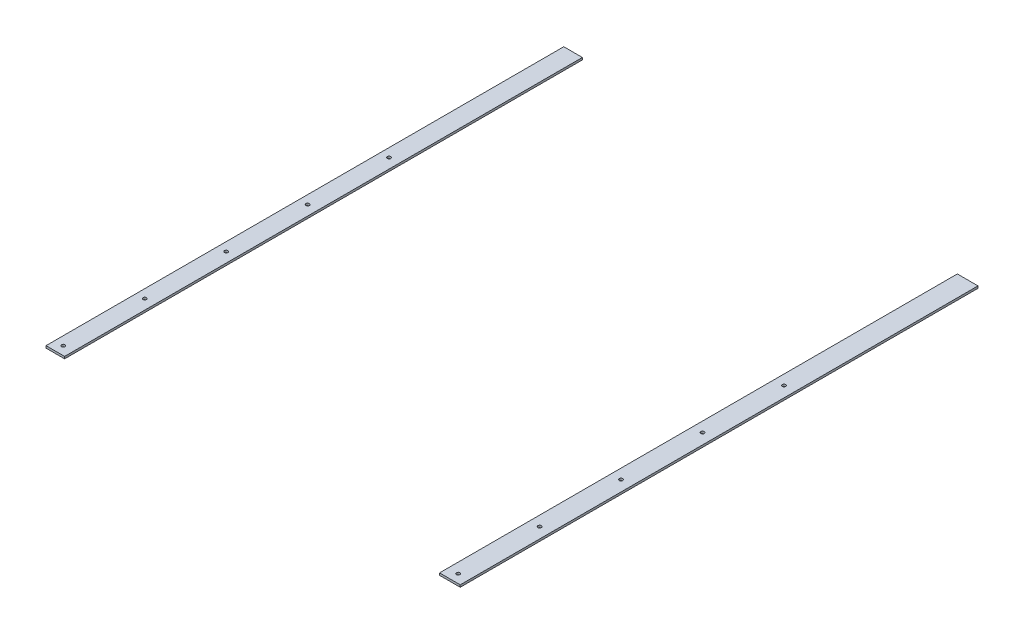
ISO-10303-21;
HEADER;
FILE_DESCRIPTION(('STEP AP214'),'2;1');
FILE_NAME('part.step','',(''),(''),'','','');
FILE_SCHEMA(('AUTOMOTIVE_DESIGN { 1 0 10303 214 1 1 1 1 }'));
ENDSEC;
DATA;
#1=APPLICATION_CONTEXT('core data for automotive mechanical design processes');
#2=APPLICATION_PROTOCOL_DEFINITION('international standard','automotive_design',2000,#1);
#3=PRODUCT_CONTEXT('',#1,'mechanical');
#4=PRODUCT('Part','Part','',(#3));
#5=PRODUCT_RELATED_PRODUCT_CATEGORY('part','',(#4));
#6=PRODUCT_DEFINITION_FORMATION('','',#4);
#7=PRODUCT_DEFINITION_CONTEXT('part definition',#1,'design');
#8=PRODUCT_DEFINITION('design','',#6,#7);
#9=PRODUCT_DEFINITION_SHAPE('','',#8);
#10=(LENGTH_UNIT() NAMED_UNIT(*) SI_UNIT(.MILLI.,.METRE.));
#11=(NAMED_UNIT(*) PLANE_ANGLE_UNIT() SI_UNIT($,.RADIAN.));
#12=(NAMED_UNIT(*) SI_UNIT($,.STERADIAN.) SOLID_ANGLE_UNIT());
#13=UNCERTAINTY_MEASURE_WITH_UNIT(LENGTH_MEASURE(1.E-05),#10,'distance_accuracy_value','');
#14=(GEOMETRIC_REPRESENTATION_CONTEXT(3) GLOBAL_UNCERTAINTY_ASSIGNED_CONTEXT((#13)) GLOBAL_UNIT_ASSIGNED_CONTEXT((#10,
#11,#12)) REPRESENTATION_CONTEXT('',''));
#15=CARTESIAN_POINT('',(0.,0.,0.));
#16=DIRECTION('',(0.,0.,1.));
#17=DIRECTION('',(1.,0.,0.));
#18=AXIS2_PLACEMENT_3D('',#15,#16,#17);
#19=CARTESIAN_POINT('',(0.,3.175,0.));
#20=DIRECTION('',(0.,-1.,0.));
#21=DIRECTION('',(0.,0.,-1.));
#22=AXIS2_PLACEMENT_3D('',#19,#20,#21);
#23=PLANE('',#22);
#24=CARTESIAN_POINT('',(12.6999999999983,3.175,-492.252));
#25=DIRECTION('',(0.,1.,0.));
#26=DIRECTION('',(0.,0.,1.));
#27=AXIS2_PLACEMENT_3D('',#24,#25,#26);
#28=CIRCLE('',#27,2.54);
#29=CARTESIAN_POINT('',(12.6999999999983,3.175,-489.712));
#30=VERTEX_POINT('',#29);
#31=EDGE_CURVE('E151',#30,#30,#28,.T.);
#32=ORIENTED_EDGE('',*,*,#31,.F.);
#33=EDGE_LOOP('',(#32));
#34=FACE_BOUND('',#33,.T.);
#35=CARTESIAN_POINT('',(12.6999999999987,3.175,-372.364));
#36=DIRECTION('',(0.,1.,0.));
#37=DIRECTION('',(0.,0.,1.));
#38=AXIS2_PLACEMENT_3D('',#35,#36,#37);
#39=CIRCLE('',#38,2.54);
#40=CARTESIAN_POINT('',(12.6999999999987,3.175,-369.824));
#41=VERTEX_POINT('',#40);
#42=EDGE_CURVE('E144',#41,#41,#39,.T.);
#43=ORIENTED_EDGE('',*,*,#42,.F.);
#44=EDGE_LOOP('',(#43));
#45=FACE_BOUND('',#44,.T.);
#46=CARTESIAN_POINT('',(12.6999999999992,3.175,-252.476));
#47=DIRECTION('',(0.,1.,0.));
#48=DIRECTION('',(0.,0.,1.));
#49=AXIS2_PLACEMENT_3D('',#46,#47,#48);
#50=CIRCLE('',#49,2.54);
#51=CARTESIAN_POINT('',(12.6999999999992,3.175,-249.936));
#52=VERTEX_POINT('',#51);
#53=EDGE_CURVE('E136',#52,#52,#50,.T.);
#54=ORIENTED_EDGE('',*,*,#53,.F.);
#55=EDGE_LOOP('',(#54));
#56=FACE_BOUND('',#55,.T.);
#57=CARTESIAN_POINT('',(12.6999999999996,3.175,-132.588));
#58=DIRECTION('',(0.,1.,0.));
#59=DIRECTION('',(0.,0.,1.));
#60=AXIS2_PLACEMENT_3D('',#57,#58,#59);
#61=CIRCLE('',#60,2.54);
#62=CARTESIAN_POINT('',(12.6999999999996,3.175,-130.048));
#63=VERTEX_POINT('',#62);
#64=EDGE_CURVE('E128',#63,#63,#61,.T.);
#65=ORIENTED_EDGE('',*,*,#64,.F.);
#66=EDGE_LOOP('',(#65));
#67=FACE_BOUND('',#66,.T.);
#68=CARTESIAN_POINT('',(12.7,3.175,-12.7));
#69=DIRECTION('',(0.,1.,0.));
#70=DIRECTION('',(0.,0.,1.));
#71=AXIS2_PLACEMENT_3D('',#68,#69,#70);
#72=CIRCLE('',#71,2.54);
#73=CARTESIAN_POINT('',(12.7,3.175,-10.16));
#74=VERTEX_POINT('',#73);
#75=EDGE_CURVE('E117',#74,#74,#72,.T.);
#76=ORIENTED_EDGE('',*,*,#75,.F.);
#77=EDGE_LOOP('',(#76));
#78=FACE_BOUND('',#77,.T.);
#79=DIRECTION('',(1.,0.,0.));
#80=VECTOR('',#79,1.);
#81=CARTESIAN_POINT('',(0.,3.175,0.));
#82=LINE('',#81,#80);
#83=CARTESIAN_POINT('',(0.,3.175,0.));
#84=VERTEX_POINT('',#83);
#85=CARTESIAN_POINT('',(27.3685809402195,3.175,0.));
#86=VERTEX_POINT('',#85);
#87=EDGE_CURVE('E94',#84,#86,#82,.T.);
#88=ORIENTED_EDGE('',*,*,#87,.T.);
#89=DIRECTION('',(0.,0.,1.));
#90=VECTOR('',#89,1.);
#91=CARTESIAN_POINT('',(27.3685809402195,3.175,0.));
#92=LINE('',#91,#90);
#93=CARTESIAN_POINT('',(27.3685809402195,3.175,-762.));
#94=VERTEX_POINT('',#93);
#95=EDGE_CURVE('E12',#94,#86,#92,.T.);
#96=ORIENTED_EDGE('',*,*,#95,.F.);
#97=DIRECTION('',(-1.,0.,0.));
#98=VECTOR('',#97,1.);
#99=CARTESIAN_POINT('',(0.,3.175,-762.));
#100=LINE('',#99,#98);
#101=CARTESIAN_POINT('',(0.,3.175,-762.));
#102=VERTEX_POINT('',#101);
#103=EDGE_CURVE('E101',#94,#102,#100,.T.);
#104=ORIENTED_EDGE('',*,*,#103,.T.);
#105=DIRECTION('',(0.,0.,1.));
#106=VECTOR('',#105,1.);
#107=CARTESIAN_POINT('',(0.,3.175,0.));
#108=LINE('',#107,#106);
#109=EDGE_CURVE('E99',#102,#84,#108,.T.);
#110=ORIENTED_EDGE('',*,*,#109,.T.);
#111=EDGE_LOOP('',(#88,#96,#104,#110));
#112=FACE_BOUND('',#111,.T.);
#113=ADVANCED_FACE('F48',(#34,#45,#56,#67,#78,#112),#23,.F.);
#114=CARTESIAN_POINT('',(0.,0.,0.));
#115=DIRECTION('',(0.,-1.,0.));
#116=DIRECTION('',(0.,0.,-1.));
#117=AXIS2_PLACEMENT_3D('',#114,#115,#116);
#118=PLANE('',#117);
#119=DIRECTION('',(0.,0.,1.));
#120=VECTOR('',#119,1.);
#121=CARTESIAN_POINT('',(27.3685809402195,0.,0.));
#122=LINE('',#121,#120);
#123=CARTESIAN_POINT('',(27.3685809402195,0.,-762.));
#124=VERTEX_POINT('',#123);
#125=CARTESIAN_POINT('',(27.3685809402195,0.,0.));
#126=VERTEX_POINT('',#125);
#127=EDGE_CURVE('E66',#124,#126,#122,.T.);
#128=ORIENTED_EDGE('',*,*,#127,.T.);
#129=DIRECTION('',(1.,0.,0.));
#130=VECTOR('',#129,1.);
#131=CARTESIAN_POINT('',(0.,0.,0.));
#132=LINE('',#131,#130);
#133=CARTESIAN_POINT('',(0.,0.,0.));
#134=VERTEX_POINT('',#133);
#135=EDGE_CURVE('E51',#134,#126,#132,.T.);
#136=ORIENTED_EDGE('',*,*,#135,.F.);
#137=DIRECTION('',(0.,0.,1.));
#138=VECTOR('',#137,1.);
#139=CARTESIAN_POINT('',(0.,0.,0.));
#140=LINE('',#139,#138);
#141=CARTESIAN_POINT('',(0.,0.,-762.));
#142=VERTEX_POINT('',#141);
#143=EDGE_CURVE('E106',#142,#134,#140,.T.);
#144=ORIENTED_EDGE('',*,*,#143,.F.);
#145=DIRECTION('',(-1.,0.,0.));
#146=VECTOR('',#145,1.);
#147=CARTESIAN_POINT('',(0.,0.,-762.));
#148=LINE('',#147,#146);
#149=EDGE_CURVE('E105',#124,#142,#148,.T.);
#150=ORIENTED_EDGE('',*,*,#149,.F.);
#151=EDGE_LOOP('',(#128,#136,#144,#150));
#152=FACE_BOUND('',#151,.T.);
#153=CARTESIAN_POINT('',(12.6999999999983,0.,-492.252));
#154=DIRECTION('',(0.,1.,0.));
#155=DIRECTION('',(0.,0.,1.));
#156=AXIS2_PLACEMENT_3D('',#153,#154,#155);
#157=CIRCLE('',#156,2.54);
#158=CARTESIAN_POINT('',(12.6999999999983,0.,-489.712));
#159=VERTEX_POINT('',#158);
#160=EDGE_CURVE('E140',#159,#159,#157,.T.);
#161=ORIENTED_EDGE('',*,*,#160,.T.);
#162=EDGE_LOOP('',(#161));
#163=FACE_BOUND('',#162,.T.);
#164=CARTESIAN_POINT('',(12.6999999999992,0.,-252.476));
#165=DIRECTION('',(0.,1.,0.));
#166=DIRECTION('',(0.,0.,1.));
#167=AXIS2_PLACEMENT_3D('',#164,#165,#166);
#168=CIRCLE('',#167,2.54);
#169=CARTESIAN_POINT('',(12.6999999999992,0.,-249.936));
#170=VERTEX_POINT('',#169);
#171=EDGE_CURVE('E125',#170,#170,#168,.T.);
#172=ORIENTED_EDGE('',*,*,#171,.T.);
#173=EDGE_LOOP('',(#172));
#174=FACE_BOUND('',#173,.T.);
#175=CARTESIAN_POINT('',(12.7,0.,-12.7));
#176=DIRECTION('',(0.,1.,0.));
#177=DIRECTION('',(0.,0.,1.));
#178=AXIS2_PLACEMENT_3D('',#175,#176,#177);
#179=CIRCLE('',#178,2.54);
#180=CARTESIAN_POINT('',(12.7,0.,-10.16));
#181=VERTEX_POINT('',#180);
#182=EDGE_CURVE('E121',#181,#181,#179,.T.);
#183=ORIENTED_EDGE('',*,*,#182,.T.);
#184=EDGE_LOOP('',(#183));
#185=FACE_BOUND('',#184,.T.);
#186=CARTESIAN_POINT('',(12.6999999999996,0.,-132.588));
#187=DIRECTION('',(0.,1.,0.));
#188=DIRECTION('',(0.,0.,1.));
#189=AXIS2_PLACEMENT_3D('',#186,#187,#188);
#190=CIRCLE('',#189,2.54);
#191=CARTESIAN_POINT('',(12.6999999999996,0.,-130.048));
#192=VERTEX_POINT('',#191);
#193=EDGE_CURVE('E124',#192,#192,#190,.T.);
#194=ORIENTED_EDGE('',*,*,#193,.T.);
#195=EDGE_LOOP('',(#194));
#196=FACE_BOUND('',#195,.T.);
#197=CARTESIAN_POINT('',(12.6999999999987,0.,-372.364));
#198=DIRECTION('',(0.,1.,0.));
#199=DIRECTION('',(0.,0.,1.));
#200=AXIS2_PLACEMENT_3D('',#197,#198,#199);
#201=CIRCLE('',#200,2.54);
#202=CARTESIAN_POINT('',(12.6999999999987,0.,-369.824));
#203=VERTEX_POINT('',#202);
#204=EDGE_CURVE('E132',#203,#203,#201,.T.);
#205=ORIENTED_EDGE('',*,*,#204,.T.);
#206=EDGE_LOOP('',(#205));
#207=FACE_BOUND('',#206,.T.);
#208=ADVANCED_FACE('F160',(#152,#163,#174,#185,#196,#207),#118,.T.);
#209=CARTESIAN_POINT('',(0.,3.175,0.));
#210=DIRECTION('',(0.,0.,-1.));
#211=DIRECTION('',(-1.,0.,0.));
#212=AXIS2_PLACEMENT_3D('',#209,#210,#211);
#213=PLANE('',#212);
#214=ORIENTED_EDGE('',*,*,#135,.T.);
#215=DIRECTION('',(0.,1.,0.));
#216=VECTOR('',#215,1.);
#217=CARTESIAN_POINT('',(27.3685809402195,-0.00100000000000013,0.));
#218=LINE('',#217,#216);
#219=EDGE_CURVE('E86',#126,#86,#218,.T.);
#220=ORIENTED_EDGE('',*,*,#219,.T.);
#221=ORIENTED_EDGE('',*,*,#87,.F.);
#222=DIRECTION('',(0.,-1.,0.));
#223=VECTOR('',#222,1.);
#224=CARTESIAN_POINT('',(0.,3.175,0.));
#225=LINE('',#224,#223);
#226=EDGE_CURVE('E96',#84,#134,#225,.T.);
#227=ORIENTED_EDGE('',*,*,#226,.T.);
#228=EDGE_LOOP('',(#214,#220,#221,#227));
#229=FACE_BOUND('',#228,.T.);
#230=ADVANCED_FACE('F92',(#229),#213,.F.);
#231=CARTESIAN_POINT('',(0.,3.175,-762.));
#232=DIRECTION('',(0.,0.,1.));
#233=DIRECTION('',(1.,0.,0.));
#234=AXIS2_PLACEMENT_3D('',#231,#232,#233);
#235=PLANE('',#234);
#236=ORIENTED_EDGE('',*,*,#103,.F.);
#237=DIRECTION('',(0.,1.,0.));
#238=VECTOR('',#237,1.);
#239=CARTESIAN_POINT('',(27.3685809402195,-0.00100000000000013,-762.));
#240=LINE('',#239,#238);
#241=EDGE_CURVE('E58',#124,#94,#240,.T.);
#242=ORIENTED_EDGE('',*,*,#241,.F.);
#243=ORIENTED_EDGE('',*,*,#149,.T.);
#244=DIRECTION('',(0.,-1.,0.));
#245=VECTOR('',#244,1.);
#246=CARTESIAN_POINT('',(0.,3.175,-762.));
#247=LINE('',#246,#245);
#248=EDGE_CURVE('E113',#102,#142,#247,.T.);
#249=ORIENTED_EDGE('',*,*,#248,.F.);
#250=EDGE_LOOP('',(#236,#242,#243,#249));
#251=FACE_BOUND('',#250,.T.);
#252=ADVANCED_FACE('F165',(#251),#235,.F.);
#253=CARTESIAN_POINT('',(0.,3.175,0.));
#254=DIRECTION('',(1.,0.,0.));
#255=DIRECTION('',(0.,0.,-1.));
#256=AXIS2_PLACEMENT_3D('',#253,#254,#255);
#257=PLANE('',#256);
#258=ORIENTED_EDGE('',*,*,#143,.T.);
#259=ORIENTED_EDGE('',*,*,#226,.F.);
#260=ORIENTED_EDGE('',*,*,#109,.F.);
#261=ORIENTED_EDGE('',*,*,#248,.T.);
#262=EDGE_LOOP('',(#258,#259,#260,#261));
#263=FACE_BOUND('',#262,.T.);
#264=ADVANCED_FACE('F164',(#263),#257,.F.);
#265=CARTESIAN_POINT('',(12.7,3.175,-12.7));
#266=DIRECTION('',(0.,-1.,0.));
#267=DIRECTION('',(0.,0.,-1.));
#268=AXIS2_PLACEMENT_3D('',#265,#266,#267);
#269=CYLINDRICAL_SURFACE('',#268,2.54);
#270=ORIENTED_EDGE('',*,*,#75,.T.);
#271=EDGE_LOOP('',(#270));
#272=FACE_BOUND('',#271,.T.);
#273=ORIENTED_EDGE('',*,*,#182,.F.);
#274=EDGE_LOOP('',(#273));
#275=FACE_BOUND('',#274,.T.);
#276=ADVANCED_FACE('F172',(#272,#275),#269,.F.);
#277=CARTESIAN_POINT('',(12.6999999999996,3.175,-132.588));
#278=DIRECTION('',(0.,-1.,0.));
#279=DIRECTION('',(0.,0.,-1.));
#280=AXIS2_PLACEMENT_3D('',#277,#278,#279);
#281=CYLINDRICAL_SURFACE('',#280,2.54);
#282=ORIENTED_EDGE('',*,*,#64,.T.);
#283=EDGE_LOOP('',(#282));
#284=FACE_BOUND('',#283,.T.);
#285=ORIENTED_EDGE('',*,*,#193,.F.);
#286=EDGE_LOOP('',(#285));
#287=FACE_BOUND('',#286,.T.);
#288=ADVANCED_FACE('F192',(#284,#287),#281,.F.);
#289=CARTESIAN_POINT('',(12.6999999999992,3.175,-252.476));
#290=DIRECTION('',(0.,-1.,0.));
#291=DIRECTION('',(0.,0.,-1.));
#292=AXIS2_PLACEMENT_3D('',#289,#290,#291);
#293=CYLINDRICAL_SURFACE('',#292,2.54);
#294=ORIENTED_EDGE('',*,*,#53,.T.);
#295=EDGE_LOOP('',(#294));
#296=FACE_BOUND('',#295,.T.);
#297=ORIENTED_EDGE('',*,*,#171,.F.);
#298=EDGE_LOOP('',(#297));
#299=FACE_BOUND('',#298,.T.);
#300=ADVANCED_FACE('F204',(#296,#299),#293,.F.);
#301=CARTESIAN_POINT('',(12.6999999999987,3.175,-372.364));
#302=DIRECTION('',(0.,-1.,0.));
#303=DIRECTION('',(0.,0.,-1.));
#304=AXIS2_PLACEMENT_3D('',#301,#302,#303);
#305=CYLINDRICAL_SURFACE('',#304,2.54);
#306=ORIENTED_EDGE('',*,*,#42,.T.);
#307=EDGE_LOOP('',(#306));
#308=FACE_BOUND('',#307,.T.);
#309=ORIENTED_EDGE('',*,*,#204,.F.);
#310=EDGE_LOOP('',(#309));
#311=FACE_BOUND('',#310,.T.);
#312=ADVANCED_FACE('F201',(#308,#311),#305,.F.);
#313=CARTESIAN_POINT('',(12.6999999999983,3.175,-492.252));
#314=DIRECTION('',(0.,-1.,0.));
#315=DIRECTION('',(0.,0.,-1.));
#316=AXIS2_PLACEMENT_3D('',#313,#314,#315);
#317=CYLINDRICAL_SURFACE('',#316,2.54);
#318=ORIENTED_EDGE('',*,*,#31,.T.);
#319=EDGE_LOOP('',(#318));
#320=FACE_BOUND('',#319,.T.);
#321=ORIENTED_EDGE('',*,*,#160,.F.);
#322=EDGE_LOOP('',(#321));
#323=FACE_BOUND('',#322,.T.);
#324=ADVANCED_FACE('F203',(#320,#323),#317,.F.);
#325=CARTESIAN_POINT('',(27.3685809402195,-0.00100000000000013,0.));
#326=DIRECTION('',(-1.,0.,0.));
#327=DIRECTION('',(0.,0.,1.));
#328=AXIS2_PLACEMENT_3D('',#325,#326,#327);
#329=PLANE('',#328);
#330=ORIENTED_EDGE('',*,*,#241,.T.);
#331=ORIENTED_EDGE('',*,*,#95,.T.);
#332=ORIENTED_EDGE('',*,*,#219,.F.);
#333=ORIENTED_EDGE('',*,*,#127,.F.);
#334=EDGE_LOOP('',(#330,#331,#332,#333));
#335=FACE_BOUND('',#334,.T.);
#336=ADVANCED_FACE('F85',(#335),#329,.F.);
#337=CLOSED_SHELL('',(#113,#208,#230,#252,#264,#276,#288,#300,#312,#324,#336));
#338=MANIFOLD_SOLID_BREP('B2',#337);
#339=CARTESIAN_POINT('',(593.851999999998,3.175,-492.252));
#340=DIRECTION('',(0.,-1.,0.));
#341=DIRECTION('',(0.,0.,-1.));
#342=AXIS2_PLACEMENT_3D('',#339,#340,#341);
#343=CYLINDRICAL_SURFACE('',#342,2.53999999999996);
#344=CARTESIAN_POINT('',(593.851999999998,3.175,-492.252));
#345=DIRECTION('',(0.,1.,0.));
#346=DIRECTION('',(0.,0.,1.));
#347=AXIS2_PLACEMENT_3D('',#344,#345,#346);
#348=CIRCLE('',#347,2.53999999999996);
#349=CARTESIAN_POINT('',(593.851999999998,3.175,-489.712));
#350=VERTEX_POINT('',#349);
#351=EDGE_CURVE('E395',#350,#350,#348,.T.);
#352=ORIENTED_EDGE('',*,*,#351,.T.);
#353=EDGE_LOOP('',(#352));
#354=FACE_BOUND('',#353,.T.);
#355=CARTESIAN_POINT('',(593.851999999998,0.,-492.252));
#356=DIRECTION('',(0.,1.,0.));
#357=DIRECTION('',(0.,0.,1.));
#358=AXIS2_PLACEMENT_3D('',#355,#356,#357);
#359=CIRCLE('',#358,2.53999999999996);
#360=CARTESIAN_POINT('',(593.851999999998,0.,-489.712));
#361=VERTEX_POINT('',#360);
#362=EDGE_CURVE('E399',#361,#361,#359,.T.);
#363=ORIENTED_EDGE('',*,*,#362,.F.);
#364=EDGE_LOOP('',(#363));
#365=FACE_BOUND('',#364,.T.);
#366=ADVANCED_FACE('F295',(#354,#365),#343,.F.);
#367=CARTESIAN_POINT('',(593.851999999999,3.175,-252.476));
#368=DIRECTION('',(0.,-1.,0.));
#369=DIRECTION('',(0.,0.,-1.));
#370=AXIS2_PLACEMENT_3D('',#367,#368,#369);
#371=CYLINDRICAL_SURFACE('',#370,2.53999999999996);
#372=CARTESIAN_POINT('',(593.851999999999,3.175,-252.476));
#373=DIRECTION('',(0.,1.,0.));
#374=DIRECTION('',(0.,0.,1.));
#375=AXIS2_PLACEMENT_3D('',#372,#373,#374);
#376=CIRCLE('',#375,2.53999999999996);
#377=CARTESIAN_POINT('',(593.851999999999,3.175,-249.936));
#378=VERTEX_POINT('',#377);
#379=EDGE_CURVE('E379',#378,#378,#376,.T.);
#380=ORIENTED_EDGE('',*,*,#379,.T.);
#381=EDGE_LOOP('',(#380));
#382=FACE_BOUND('',#381,.T.);
#383=CARTESIAN_POINT('',(593.851999999999,0.,-252.476));
#384=DIRECTION('',(0.,1.,0.));
#385=DIRECTION('',(0.,0.,1.));
#386=AXIS2_PLACEMENT_3D('',#383,#384,#385);
#387=CIRCLE('',#386,2.53999999999996);
#388=CARTESIAN_POINT('',(593.851999999999,0.,-249.936));
#389=VERTEX_POINT('',#388);
#390=EDGE_CURVE('E383',#389,#389,#387,.T.);
#391=ORIENTED_EDGE('',*,*,#390,.F.);
#392=EDGE_LOOP('',(#391));
#393=FACE_BOUND('',#392,.T.);
#394=ADVANCED_FACE('F433',(#382,#393),#371,.F.);
#395=CARTESIAN_POINT('',(593.852,3.175,-12.7));
#396=DIRECTION('',(0.,-1.,0.));
#397=DIRECTION('',(0.,0.,-1.));
#398=AXIS2_PLACEMENT_3D('',#395,#396,#397);
#399=CYLINDRICAL_SURFACE('',#398,2.53999999999996);
#400=CARTESIAN_POINT('',(593.852,3.175,-12.7));
#401=DIRECTION('',(0.,1.,0.));
#402=DIRECTION('',(0.,0.,1.));
#403=AXIS2_PLACEMENT_3D('',#400,#401,#402);
#404=CIRCLE('',#403,2.53999999999996);
#405=CARTESIAN_POINT('',(593.852,3.175,-10.16));
#406=VERTEX_POINT('',#405);
#407=EDGE_CURVE('E363',#406,#406,#404,.T.);
#408=ORIENTED_EDGE('',*,*,#407,.T.);
#409=EDGE_LOOP('',(#408));
#410=FACE_BOUND('',#409,.T.);
#411=CARTESIAN_POINT('',(593.852,0.,-12.7));
#412=DIRECTION('',(0.,1.,0.));
#413=DIRECTION('',(0.,0.,1.));
#414=AXIS2_PLACEMENT_3D('',#411,#412,#413);
#415=CIRCLE('',#414,2.53999999999996);
#416=CARTESIAN_POINT('',(593.852,0.,-10.16));
#417=VERTEX_POINT('',#416);
#418=EDGE_CURVE('E367',#417,#417,#415,.T.);
#419=ORIENTED_EDGE('',*,*,#418,.F.);
#420=EDGE_LOOP('',(#419));
#421=FACE_BOUND('',#420,.T.);
#422=ADVANCED_FACE('F438',(#410,#421),#399,.F.);
#423=CARTESIAN_POINT('',(593.852,3.175,-132.588));
#424=DIRECTION('',(0.,-1.,0.));
#425=DIRECTION('',(0.,0.,-1.));
#426=AXIS2_PLACEMENT_3D('',#423,#424,#425);
#427=CYLINDRICAL_SURFACE('',#426,2.53999999999996);
#428=CARTESIAN_POINT('',(593.852,3.175,-132.588));
#429=DIRECTION('',(0.,1.,0.));
#430=DIRECTION('',(0.,0.,1.));
#431=AXIS2_PLACEMENT_3D('',#428,#429,#430);
#432=CIRCLE('',#431,2.53999999999996);
#433=CARTESIAN_POINT('',(593.852,3.175,-130.048));
#434=VERTEX_POINT('',#433);
#435=EDGE_CURVE('E371',#434,#434,#432,.T.);
#436=ORIENTED_EDGE('',*,*,#435,.T.);
#437=EDGE_LOOP('',(#436));
#438=FACE_BOUND('',#437,.T.);
#439=CARTESIAN_POINT('',(593.852,0.,-132.588));
#440=DIRECTION('',(0.,1.,0.));
#441=DIRECTION('',(0.,0.,1.));
#442=AXIS2_PLACEMENT_3D('',#439,#440,#441);
#443=CIRCLE('',#442,2.53999999999996);
#444=CARTESIAN_POINT('',(593.852,0.,-130.048));
#445=VERTEX_POINT('',#444);
#446=EDGE_CURVE('E375',#445,#445,#443,.T.);
#447=ORIENTED_EDGE('',*,*,#446,.F.);
#448=EDGE_LOOP('',(#447));
#449=FACE_BOUND('',#448,.T.);
#450=ADVANCED_FACE('F445',(#438,#449),#427,.F.);
#451=CARTESIAN_POINT('',(593.851999999999,3.175,-372.364));
#452=DIRECTION('',(0.,-1.,0.));
#453=DIRECTION('',(0.,0.,-1.));
#454=AXIS2_PLACEMENT_3D('',#451,#452,#453);
#455=CYLINDRICAL_SURFACE('',#454,2.53999999999996);
#456=CARTESIAN_POINT('',(593.851999999999,3.175,-372.364));
#457=DIRECTION('',(0.,1.,0.));
#458=DIRECTION('',(0.,0.,1.));
#459=AXIS2_PLACEMENT_3D('',#456,#457,#458);
#460=CIRCLE('',#459,2.53999999999996);
#461=CARTESIAN_POINT('',(593.851999999999,3.175,-369.824));
#462=VERTEX_POINT('',#461);
#463=EDGE_CURVE('E387',#462,#462,#460,.T.);
#464=ORIENTED_EDGE('',*,*,#463,.T.);
#465=EDGE_LOOP('',(#464));
#466=FACE_BOUND('',#465,.T.);
#467=CARTESIAN_POINT('',(593.851999999999,0.,-372.364));
#468=DIRECTION('',(0.,1.,0.));
#469=DIRECTION('',(0.,0.,1.));
#470=AXIS2_PLACEMENT_3D('',#467,#468,#469);
#471=CIRCLE('',#470,2.53999999999996);
#472=CARTESIAN_POINT('',(593.851999999999,0.,-369.824));
#473=VERTEX_POINT('',#472);
#474=EDGE_CURVE('E391',#473,#473,#471,.T.);
#475=ORIENTED_EDGE('',*,*,#474,.F.);
#476=EDGE_LOOP('',(#475));
#477=FACE_BOUND('',#476,.T.);
#478=ADVANCED_FACE('F443',(#466,#477),#455,.F.);
#479=CARTESIAN_POINT('',(609.6,3.175,0.));
#480=DIRECTION('',(-1.,0.,0.));
#481=DIRECTION('',(0.,0.,1.));
#482=AXIS2_PLACEMENT_3D('',#479,#480,#481);
#483=PLANE('',#482);
#484=DIRECTION('',(0.,0.,-1.));
#485=VECTOR('',#484,1.);
#486=CARTESIAN_POINT('',(609.6,0.,0.));
#487=LINE('',#486,#485);
#488=CARTESIAN_POINT('',(609.6,0.,0.));
#489=VERTEX_POINT('',#488);
#490=CARTESIAN_POINT('',(609.6,0.,-762.));
#491=VERTEX_POINT('',#490);
#492=EDGE_CURVE('E334',#489,#491,#487,.T.);
#493=ORIENTED_EDGE('',*,*,#492,.T.);
#494=DIRECTION('',(0.,-1.,0.));
#495=VECTOR('',#494,1.);
#496=CARTESIAN_POINT('',(609.6,3.175,-762.));
#497=LINE('',#496,#495);
#498=CARTESIAN_POINT('',(609.6,3.175,-762.));
#499=VERTEX_POINT('',#498);
#500=EDGE_CURVE('E304',#499,#491,#497,.T.);
#501=ORIENTED_EDGE('',*,*,#500,.F.);
#502=DIRECTION('',(0.,0.,-1.));
#503=VECTOR('',#502,1.);
#504=CARTESIAN_POINT('',(609.6,3.175,0.));
#505=LINE('',#504,#503);
#506=CARTESIAN_POINT('',(609.6,3.175,0.));
#507=VERTEX_POINT('',#506);
#508=EDGE_CURVE('E320',#507,#499,#505,.T.);
#509=ORIENTED_EDGE('',*,*,#508,.F.);
#510=DIRECTION('',(0.,-1.,0.));
#511=VECTOR('',#510,1.);
#512=CARTESIAN_POINT('',(609.6,3.175,0.));
#513=LINE('',#512,#511);
#514=EDGE_CURVE('E46',#507,#489,#513,.T.);
#515=ORIENTED_EDGE('',*,*,#514,.T.);
#516=EDGE_LOOP('',(#493,#501,#509,#515));
#517=FACE_BOUND('',#516,.T.);
#518=ADVANCED_FACE('F336',(#517),#483,.F.);
#519=CARTESIAN_POINT('',(0.,3.175,0.));
#520=DIRECTION('',(0.,0.,-1.));
#521=DIRECTION('',(-1.,0.,0.));
#522=AXIS2_PLACEMENT_3D('',#519,#520,#521);
#523=PLANE('',#522);
#524=DIRECTION('',(1.,0.,0.));
#525=VECTOR('',#524,1.);
#526=CARTESIAN_POINT('',(0.,3.175,0.));
#527=LINE('',#526,#525);
#528=CARTESIAN_POINT('',(579.183419059781,3.175,0.));
#529=VERTEX_POINT('',#528);
#530=EDGE_CURVE('E356',#529,#507,#527,.T.);
#531=ORIENTED_EDGE('',*,*,#530,.F.);
#532=DIRECTION('',(0.,1.,0.));
#533=VECTOR('',#532,1.);
#534=CARTESIAN_POINT('',(579.183419059781,-0.00100000000000013,0.));
#535=LINE('',#534,#533);
#536=CARTESIAN_POINT('',(579.183419059781,0.,0.));
#537=VERTEX_POINT('',#536);
#538=EDGE_CURVE('E407',#537,#529,#535,.T.);
#539=ORIENTED_EDGE('',*,*,#538,.F.);
#540=DIRECTION('',(1.,0.,0.));
#541=VECTOR('',#540,1.);
#542=CARTESIAN_POINT('',(0.,0.,0.));
#543=LINE('',#542,#541);
#544=EDGE_CURVE('E344',#537,#489,#543,.T.);
#545=ORIENTED_EDGE('',*,*,#544,.T.);
#546=ORIENTED_EDGE('',*,*,#514,.F.);
#547=EDGE_LOOP('',(#531,#539,#545,#546));
#548=FACE_BOUND('',#547,.T.);
#549=ADVANCED_FACE('F297',(#548),#523,.F.);
#550=CARTESIAN_POINT('',(0.,3.175,-762.));
#551=DIRECTION('',(0.,0.,1.));
#552=DIRECTION('',(1.,0.,0.));
#553=AXIS2_PLACEMENT_3D('',#550,#551,#552);
#554=PLANE('',#553);
#555=DIRECTION('',(-1.,0.,0.));
#556=VECTOR('',#555,1.);
#557=CARTESIAN_POINT('',(0.,0.,-762.));
#558=LINE('',#557,#556);
#559=CARTESIAN_POINT('',(579.18341905978,0.,-762.));
#560=VERTEX_POINT('',#559);
#561=EDGE_CURVE('E343',#491,#560,#558,.T.);
#562=ORIENTED_EDGE('',*,*,#561,.T.);
#563=DIRECTION('',(0.,1.,0.));
#564=VECTOR('',#563,1.);
#565=CARTESIAN_POINT('',(579.183419059781,-0.00100000000000013,-762.));
#566=LINE('',#565,#564);
#567=CARTESIAN_POINT('',(579.18341905978,3.175,-762.));
#568=VERTEX_POINT('',#567);
#569=EDGE_CURVE('E403',#560,#568,#566,.T.);
#570=ORIENTED_EDGE('',*,*,#569,.T.);
#571=DIRECTION('',(-1.,0.,0.));
#572=VECTOR('',#571,1.);
#573=CARTESIAN_POINT('',(0.,3.175,-762.));
#574=LINE('',#573,#572);
#575=EDGE_CURVE('E350',#499,#568,#574,.T.);
#576=ORIENTED_EDGE('',*,*,#575,.F.);
#577=ORIENTED_EDGE('',*,*,#500,.T.);
#578=EDGE_LOOP('',(#562,#570,#576,#577));
#579=FACE_BOUND('',#578,.T.);
#580=ADVANCED_FACE('F348',(#579),#554,.F.);
#581=CARTESIAN_POINT('',(0.,0.,0.));
#582=DIRECTION('',(0.,-1.,0.));
#583=DIRECTION('',(0.,0.,-1.));
#584=AXIS2_PLACEMENT_3D('',#581,#582,#583);
#585=PLANE('',#584);
#586=DIRECTION('',(0.,0.,-1.));
#587=VECTOR('',#586,1.);
#588=CARTESIAN_POINT('',(579.183419059781,0.,0.));
#589=LINE('',#588,#587);
#590=EDGE_CURVE('E355',#537,#560,#589,.T.);
#591=ORIENTED_EDGE('',*,*,#590,.T.);
#592=ORIENTED_EDGE('',*,*,#561,.F.);
#593=ORIENTED_EDGE('',*,*,#492,.F.);
#594=ORIENTED_EDGE('',*,*,#544,.F.);
#595=EDGE_LOOP('',(#591,#592,#593,#594));
#596=FACE_BOUND('',#595,.T.);
#597=ORIENTED_EDGE('',*,*,#474,.T.);
#598=EDGE_LOOP('',(#597));
#599=FACE_BOUND('',#598,.T.);
#600=ORIENTED_EDGE('',*,*,#446,.T.);
#601=EDGE_LOOP('',(#600));
#602=FACE_BOUND('',#601,.T.);
#603=ORIENTED_EDGE('',*,*,#418,.T.);
#604=EDGE_LOOP('',(#603));
#605=FACE_BOUND('',#604,.T.);
#606=ORIENTED_EDGE('',*,*,#390,.T.);
#607=EDGE_LOOP('',(#606));
#608=FACE_BOUND('',#607,.T.);
#609=ORIENTED_EDGE('',*,*,#362,.T.);
#610=EDGE_LOOP('',(#609));
#611=FACE_BOUND('',#610,.T.);
#612=ADVANCED_FACE('F352',(#596,#599,#602,#605,#608,#611),#585,.T.);
#613=CARTESIAN_POINT('',(0.,3.175,0.));
#614=DIRECTION('',(0.,-1.,0.));
#615=DIRECTION('',(0.,0.,-1.));
#616=AXIS2_PLACEMENT_3D('',#613,#614,#615);
#617=PLANE('',#616);
#618=ORIENTED_EDGE('',*,*,#575,.T.);
#619=DIRECTION('',(0.,0.,-1.));
#620=VECTOR('',#619,1.);
#621=CARTESIAN_POINT('',(579.183419059781,3.175,0.));
#622=LINE('',#621,#620);
#623=EDGE_CURVE('E311',#529,#568,#622,.T.);
#624=ORIENTED_EDGE('',*,*,#623,.F.);
#625=ORIENTED_EDGE('',*,*,#530,.T.);
#626=ORIENTED_EDGE('',*,*,#508,.T.);
#627=EDGE_LOOP('',(#618,#624,#625,#626));
#628=FACE_BOUND('',#627,.T.);
#629=ORIENTED_EDGE('',*,*,#407,.F.);
#630=EDGE_LOOP('',(#629));
#631=FACE_BOUND('',#630,.T.);
#632=ORIENTED_EDGE('',*,*,#435,.F.);
#633=EDGE_LOOP('',(#632));
#634=FACE_BOUND('',#633,.T.);
#635=ORIENTED_EDGE('',*,*,#379,.F.);
#636=EDGE_LOOP('',(#635));
#637=FACE_BOUND('',#636,.T.);
#638=ORIENTED_EDGE('',*,*,#463,.F.);
#639=EDGE_LOOP('',(#638));
#640=FACE_BOUND('',#639,.T.);
#641=ORIENTED_EDGE('',*,*,#351,.F.);
#642=EDGE_LOOP('',(#641));
#643=FACE_BOUND('',#642,.T.);
#644=ADVANCED_FACE('F414',(#628,#631,#634,#637,#640,#643),#617,.F.);
#645=CARTESIAN_POINT('',(579.183419059781,-0.00100000000000013,0.));
#646=DIRECTION('',(1.,0.,0.));
#647=DIRECTION('',(0.,0.,-1.));
#648=AXIS2_PLACEMENT_3D('',#645,#646,#647);
#649=PLANE('',#648);
#650=ORIENTED_EDGE('',*,*,#538,.T.);
#651=ORIENTED_EDGE('',*,*,#623,.T.);
#652=ORIENTED_EDGE('',*,*,#569,.F.);
#653=ORIENTED_EDGE('',*,*,#590,.F.);
#654=EDGE_LOOP('',(#650,#651,#652,#653));
#655=FACE_BOUND('',#654,.T.);
#656=ADVANCED_FACE('F424',(#655),#649,.F.);
#657=CLOSED_SHELL('',(#366,#394,#422,#450,#478,#518,#549,#580,#612,#644,#656));
#658=MANIFOLD_SOLID_BREP('B6',#657);
#659=ADVANCED_BREP_SHAPE_REPRESENTATION('',(#18,#338,#658),#14);
#660=SHAPE_DEFINITION_REPRESENTATION(#9,#659);
ENDSEC;
END-ISO-10303-21;
